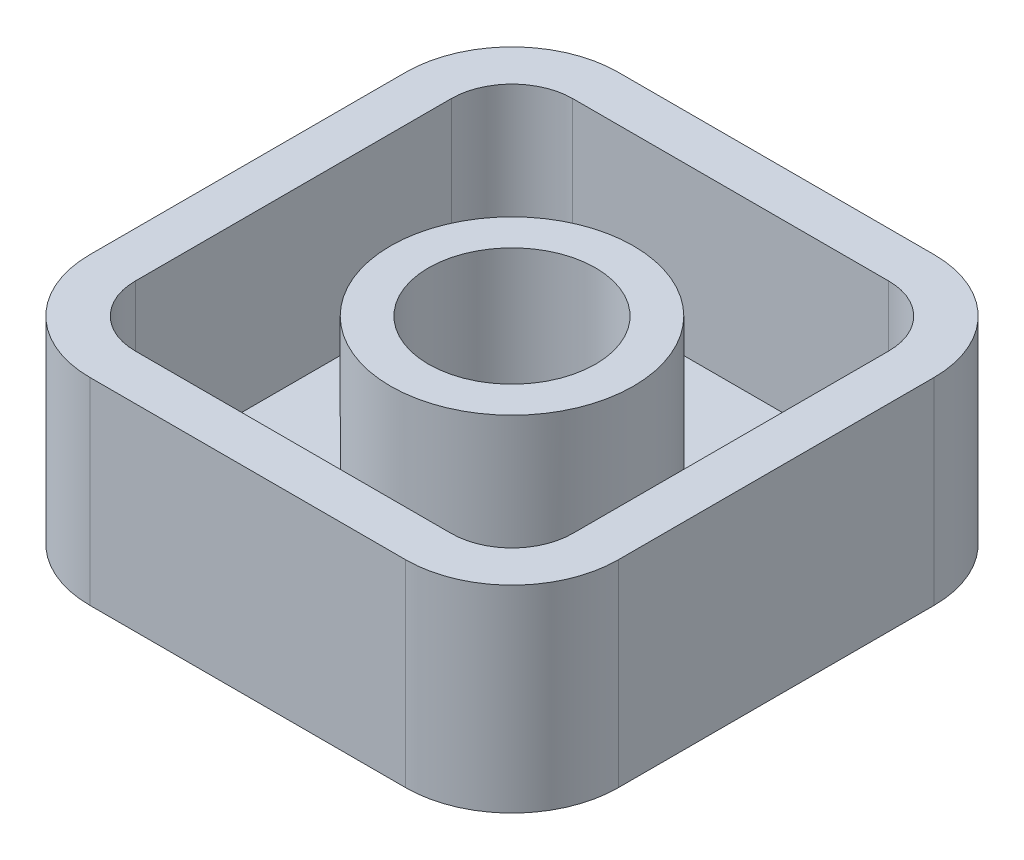
ISO-10303-21;
HEADER;
FILE_DESCRIPTION(('STEP AP214'),'2;1');
FILE_NAME('part.step','',(''),(''),'','','');
FILE_SCHEMA(('AUTOMOTIVE_DESIGN { 1 0 10303 214 1 1 1 1 }'));
ENDSEC;
DATA;
#1=APPLICATION_CONTEXT('core data for automotive mechanical design processes');
#2=APPLICATION_PROTOCOL_DEFINITION('international standard','automotive_design',2000,#1);
#3=PRODUCT_CONTEXT('',#1,'mechanical');
#4=PRODUCT('Part','Part','',(#3));
#5=PRODUCT_RELATED_PRODUCT_CATEGORY('part','',(#4));
#6=PRODUCT_DEFINITION_FORMATION('','',#4);
#7=PRODUCT_DEFINITION_CONTEXT('part definition',#1,'design');
#8=PRODUCT_DEFINITION('design','',#6,#7);
#9=PRODUCT_DEFINITION_SHAPE('','',#8);
#10=(LENGTH_UNIT() NAMED_UNIT(*) SI_UNIT(.MILLI.,.METRE.));
#11=(NAMED_UNIT(*) PLANE_ANGLE_UNIT() SI_UNIT($,.RADIAN.));
#12=(NAMED_UNIT(*) SI_UNIT($,.STERADIAN.) SOLID_ANGLE_UNIT());
#13=UNCERTAINTY_MEASURE_WITH_UNIT(LENGTH_MEASURE(1.E-05),#10,'distance_accuracy_value','');
#14=(GEOMETRIC_REPRESENTATION_CONTEXT(3) GLOBAL_UNCERTAINTY_ASSIGNED_CONTEXT((#13)) GLOBAL_UNIT_ASSIGNED_CONTEXT((#10,
#11,#12)) REPRESENTATION_CONTEXT('',''));
#15=CARTESIAN_POINT('',(0.,0.,0.));
#16=DIRECTION('',(0.,0.,1.));
#17=DIRECTION('',(1.,0.,0.));
#18=AXIS2_PLACEMENT_3D('',#15,#16,#17);
#19=CARTESIAN_POINT('',(0.,6.5,0.));
#20=DIRECTION('',(-1.,0.,0.));
#21=DIRECTION('',(0.,0.,1.));
#22=AXIS2_PLACEMENT_3D('',#19,#20,#21);
#23=PLANE('',#22);
#24=DIRECTION('',(0.,0.,-1.));
#25=VECTOR('',#24,1.);
#26=CARTESIAN_POINT('',(0.,0.,0.));
#27=LINE('',#26,#25);
#28=CARTESIAN_POINT('',(0.,0.,13.9));
#29=VERTEX_POINT('',#28);
#30=CARTESIAN_POINT('',(0.,0.,3.5));
#31=VERTEX_POINT('',#30);
#32=EDGE_CURVE('E217',#29,#31,#27,.T.);
#33=ORIENTED_EDGE('',*,*,#32,.T.);
#34=DIRECTION('',(0.,-1.,0.));
#35=VECTOR('',#34,1.);
#36=CARTESIAN_POINT('',(0.,6.5,3.5));
#37=LINE('',#36,#35);
#38=CARTESIAN_POINT('',(0.,6.5,3.5));
#39=VERTEX_POINT('',#38);
#40=EDGE_CURVE('E48',#31,#39,#37,.F.);
#41=ORIENTED_EDGE('',*,*,#40,.T.);
#42=DIRECTION('',(0.,0.,-1.));
#43=VECTOR('',#42,1.);
#44=CARTESIAN_POINT('',(0.,6.5,0.));
#45=LINE('',#44,#43);
#46=CARTESIAN_POINT('',(0.,6.5,13.9));
#47=VERTEX_POINT('',#46);
#48=EDGE_CURVE('E229',#47,#39,#45,.T.);
#49=ORIENTED_EDGE('',*,*,#48,.F.);
#50=DIRECTION('',(0.,-1.,0.));
#51=VECTOR('',#50,1.);
#52=CARTESIAN_POINT('',(0.,6.5,13.9));
#53=LINE('',#52,#51);
#54=EDGE_CURVE('E280',#47,#29,#53,.T.);
#55=ORIENTED_EDGE('',*,*,#54,.T.);
#56=EDGE_LOOP('',(#33,#41,#49,#55));
#57=FACE_BOUND('',#56,.T.);
#58=ADVANCED_FACE('F40',(#57),#23,.F.);
#59=CARTESIAN_POINT('',(0.,6.5,0.));
#60=DIRECTION('',(0.,0.,1.));
#61=DIRECTION('',(1.,0.,0.));
#62=AXIS2_PLACEMENT_3D('',#59,#60,#61);
#63=PLANE('',#62);
#64=DIRECTION('',(-1.,0.,0.));
#65=VECTOR('',#64,1.);
#66=CARTESIAN_POINT('',(0.,0.,0.));
#67=LINE('',#66,#65);
#68=CARTESIAN_POINT('',(-3.5,0.,0.));
#69=VERTEX_POINT('',#68);
#70=CARTESIAN_POINT('',(-13.9,0.,0.));
#71=VERTEX_POINT('',#70);
#72=EDGE_CURVE('E244',#69,#71,#67,.T.);
#73=ORIENTED_EDGE('',*,*,#72,.T.);
#74=DIRECTION('',(0.,-1.,0.));
#75=VECTOR('',#74,1.);
#76=CARTESIAN_POINT('',(-13.9,6.5,0.));
#77=LINE('',#76,#75);
#78=CARTESIAN_POINT('',(-13.9,6.5,0.));
#79=VERTEX_POINT('',#78);
#80=EDGE_CURVE('E63',#71,#79,#77,.F.);
#81=ORIENTED_EDGE('',*,*,#80,.T.);
#82=DIRECTION('',(-1.,0.,0.));
#83=VECTOR('',#82,1.);
#84=CARTESIAN_POINT('',(0.,6.5,0.));
#85=LINE('',#84,#83);
#86=CARTESIAN_POINT('',(-3.5,6.5,0.));
#87=VERTEX_POINT('',#86);
#88=EDGE_CURVE('E232',#87,#79,#85,.T.);
#89=ORIENTED_EDGE('',*,*,#88,.F.);
#90=DIRECTION('',(0.,-1.,0.));
#91=VECTOR('',#90,1.);
#92=CARTESIAN_POINT('',(-3.5,6.5,0.));
#93=LINE('',#92,#91);
#94=EDGE_CURVE('E276',#87,#69,#93,.T.);
#95=ORIENTED_EDGE('',*,*,#94,.T.);
#96=EDGE_LOOP('',(#73,#81,#89,#95));
#97=FACE_BOUND('',#96,.T.);
#98=ADVANCED_FACE('F295',(#97),#63,.F.);
#99=CARTESIAN_POINT('',(-17.4,6.5,0.));
#100=DIRECTION('',(1.,0.,0.));
#101=DIRECTION('',(0.,0.,-1.));
#102=AXIS2_PLACEMENT_3D('',#99,#100,#101);
#103=PLANE('',#102);
#104=DIRECTION('',(0.,0.,1.));
#105=VECTOR('',#104,1.);
#106=CARTESIAN_POINT('',(-17.4,0.,0.));
#107=LINE('',#106,#105);
#108=CARTESIAN_POINT('',(-17.4,0.,3.5));
#109=VERTEX_POINT('',#108);
#110=CARTESIAN_POINT('',(-17.4,0.,13.9));
#111=VERTEX_POINT('',#110);
#112=EDGE_CURVE('E246',#109,#111,#107,.T.);
#113=ORIENTED_EDGE('',*,*,#112,.T.);
#114=DIRECTION('',(0.,-1.,0.));
#115=VECTOR('',#114,1.);
#116=CARTESIAN_POINT('',(-17.4,6.5,13.9));
#117=LINE('',#116,#115);
#118=CARTESIAN_POINT('',(-17.4,6.5,13.9));
#119=VERTEX_POINT('',#118);
#120=EDGE_CURVE('E266',#111,#119,#117,.F.);
#121=ORIENTED_EDGE('',*,*,#120,.T.);
#122=DIRECTION('',(0.,0.,1.));
#123=VECTOR('',#122,1.);
#124=CARTESIAN_POINT('',(-17.4,6.5,0.));
#125=LINE('',#124,#123);
#126=CARTESIAN_POINT('',(-17.4,6.5,3.5));
#127=VERTEX_POINT('',#126);
#128=EDGE_CURVE('E235',#127,#119,#125,.T.);
#129=ORIENTED_EDGE('',*,*,#128,.F.);
#130=DIRECTION('',(0.,-1.,0.));
#131=VECTOR('',#130,1.);
#132=CARTESIAN_POINT('',(-17.4,6.5,3.5));
#133=LINE('',#132,#131);
#134=EDGE_CURVE('E263',#127,#109,#133,.T.);
#135=ORIENTED_EDGE('',*,*,#134,.T.);
#136=EDGE_LOOP('',(#113,#121,#129,#135));
#137=FACE_BOUND('',#136,.T.);
#138=ADVANCED_FACE('F306',(#137),#103,.F.);
#139=CARTESIAN_POINT('',(0.,6.5,17.4));
#140=DIRECTION('',(0.,0.,-1.));
#141=DIRECTION('',(-1.,0.,0.));
#142=AXIS2_PLACEMENT_3D('',#139,#140,#141);
#143=PLANE('',#142);
#144=DIRECTION('',(1.,0.,0.));
#145=VECTOR('',#144,1.);
#146=CARTESIAN_POINT('',(0.,6.5,17.4));
#147=LINE('',#146,#145);
#148=CARTESIAN_POINT('',(-13.9,6.5,17.4));
#149=VERTEX_POINT('',#148);
#150=CARTESIAN_POINT('',(-3.5,6.5,17.4));
#151=VERTEX_POINT('',#150);
#152=EDGE_CURVE('E238',#149,#151,#147,.T.);
#153=ORIENTED_EDGE('',*,*,#152,.F.);
#154=DIRECTION('',(0.,-1.,0.));
#155=VECTOR('',#154,1.);
#156=CARTESIAN_POINT('',(-13.9,6.5,17.4));
#157=LINE('',#156,#155);
#158=CARTESIAN_POINT('',(-13.9,0.,17.4));
#159=VERTEX_POINT('',#158);
#160=EDGE_CURVE('E252',#149,#159,#157,.T.);
#161=ORIENTED_EDGE('',*,*,#160,.T.);
#162=DIRECTION('',(1.,0.,0.));
#163=VECTOR('',#162,1.);
#164=CARTESIAN_POINT('',(0.,0.,17.4));
#165=LINE('',#164,#163);
#166=CARTESIAN_POINT('',(-3.5,0.,17.4));
#167=VERTEX_POINT('',#166);
#168=EDGE_CURVE('E233',#159,#167,#165,.T.);
#169=ORIENTED_EDGE('',*,*,#168,.T.);
#170=DIRECTION('',(0.,-1.,0.));
#171=VECTOR('',#170,1.);
#172=CARTESIAN_POINT('',(-3.5,6.5,17.4));
#173=LINE('',#172,#171);
#174=EDGE_CURVE('E241',#167,#151,#173,.F.);
#175=ORIENTED_EDGE('',*,*,#174,.T.);
#176=EDGE_LOOP('',(#153,#161,#169,#175));
#177=FACE_BOUND('',#176,.T.);
#178=ADVANCED_FACE('F314',(#177),#143,.F.);
#179=CARTESIAN_POINT('',(0.,6.5,0.));
#180=DIRECTION('',(0.,-1.,0.));
#181=DIRECTION('',(0.,0.,-1.));
#182=AXIS2_PLACEMENT_3D('',#179,#180,#181);
#183=PLANE('',#182);
#184=DIRECTION('',(1.,0.,0.));
#185=VECTOR('',#184,1.);
#186=CARTESIAN_POINT('',(-13.9,6.5,15.9));
#187=LINE('',#186,#185);
#188=CARTESIAN_POINT('',(-13.9,6.5,15.9));
#189=VERTEX_POINT('',#188);
#190=CARTESIAN_POINT('',(-3.5,6.5,15.9));
#191=VERTEX_POINT('',#190);
#192=EDGE_CURVE('E199',#189,#191,#187,.T.);
#193=ORIENTED_EDGE('',*,*,#192,.F.);
#194=CARTESIAN_POINT('',(-13.9,6.5,13.9));
#195=DIRECTION('',(0.,1.,0.));
#196=DIRECTION('',(0.,0.,-1.));
#197=AXIS2_PLACEMENT_3D('',#194,#195,#196);
#198=CIRCLE('',#197,2.);
#199=CARTESIAN_POINT('',(-15.9,6.5,13.9));
#200=VERTEX_POINT('',#199);
#201=EDGE_CURVE('E55',#200,#189,#198,.T.);
#202=ORIENTED_EDGE('',*,*,#201,.F.);
#203=DIRECTION('',(0.,0.,1.));
#204=VECTOR('',#203,1.);
#205=CARTESIAN_POINT('',(-15.9,6.5,13.9));
#206=LINE('',#205,#204);
#207=CARTESIAN_POINT('',(-15.9,6.5,3.5));
#208=VERTEX_POINT('',#207);
#209=EDGE_CURVE('E176',#208,#200,#206,.T.);
#210=ORIENTED_EDGE('',*,*,#209,.F.);
#211=CARTESIAN_POINT('',(-13.9,6.5,3.5));
#212=DIRECTION('',(0.,1.,0.));
#213=DIRECTION('',(0.,0.,1.));
#214=AXIS2_PLACEMENT_3D('',#211,#212,#213);
#215=CIRCLE('',#214,2.);
#216=CARTESIAN_POINT('',(-13.9,6.5,1.5));
#217=VERTEX_POINT('',#216);
#218=EDGE_CURVE('E179',#217,#208,#215,.T.);
#219=ORIENTED_EDGE('',*,*,#218,.F.);
#220=DIRECTION('',(-1.,0.,0.));
#221=VECTOR('',#220,1.);
#222=CARTESIAN_POINT('',(-13.9,6.5,1.5));
#223=LINE('',#222,#221);
#224=CARTESIAN_POINT('',(-3.50000000000001,6.5,1.5));
#225=VERTEX_POINT('',#224);
#226=EDGE_CURVE('E210',#225,#217,#223,.T.);
#227=ORIENTED_EDGE('',*,*,#226,.F.);
#228=CARTESIAN_POINT('',(-3.5,6.5,3.5));
#229=DIRECTION('',(0.,1.,0.));
#230=DIRECTION('',(0.,0.,-1.));
#231=AXIS2_PLACEMENT_3D('',#228,#229,#230);
#232=CIRCLE('',#231,2.);
#233=CARTESIAN_POINT('',(-1.5,6.5,3.50000000000001));
#234=VERTEX_POINT('',#233);
#235=EDGE_CURVE('E207',#234,#225,#232,.T.);
#236=ORIENTED_EDGE('',*,*,#235,.F.);
#237=DIRECTION('',(0.,0.,-1.));
#238=VECTOR('',#237,1.);
#239=CARTESIAN_POINT('',(-1.5,6.5,13.9));
#240=LINE('',#239,#238);
#241=CARTESIAN_POINT('',(-1.5,6.5,13.9));
#242=VERTEX_POINT('',#241);
#243=EDGE_CURVE('E204',#242,#234,#240,.T.);
#244=ORIENTED_EDGE('',*,*,#243,.F.);
#245=CARTESIAN_POINT('',(-3.5,6.5,13.9));
#246=DIRECTION('',(0.,1.,0.));
#247=DIRECTION('',(0.,0.,1.));
#248=AXIS2_PLACEMENT_3D('',#245,#246,#247);
#249=CIRCLE('',#248,2.);
#250=EDGE_CURVE('E201',#191,#242,#249,.T.);
#251=ORIENTED_EDGE('',*,*,#250,.F.);
#252=EDGE_LOOP('',(#193,#202,#210,#219,#227,#236,#244,#251));
#253=FACE_BOUND('',#252,.T.);
#254=ORIENTED_EDGE('',*,*,#128,.T.);
#255=CARTESIAN_POINT('',(-13.9,6.5,13.9));
#256=DIRECTION('',(0.,-1.,0.));
#257=DIRECTION('',(0.,0.,-1.));
#258=AXIS2_PLACEMENT_3D('',#255,#256,#257);
#259=CIRCLE('',#258,3.5);
#260=EDGE_CURVE('E274',#119,#149,#259,.F.);
#261=ORIENTED_EDGE('',*,*,#260,.T.);
#262=ORIENTED_EDGE('',*,*,#152,.T.);
#263=CARTESIAN_POINT('',(-3.5,6.5,13.9));
#264=DIRECTION('',(0.,-1.,0.));
#265=DIRECTION('',(0.,0.,-1.));
#266=AXIS2_PLACEMENT_3D('',#263,#264,#265);
#267=CIRCLE('',#266,3.5);
#268=EDGE_CURVE('E268',#151,#47,#267,.F.);
#269=ORIENTED_EDGE('',*,*,#268,.T.);
#270=ORIENTED_EDGE('',*,*,#48,.T.);
#271=CARTESIAN_POINT('',(-3.5,6.5,3.5));
#272=DIRECTION('',(0.,-1.,0.));
#273=DIRECTION('',(0.,0.,-1.));
#274=AXIS2_PLACEMENT_3D('',#271,#272,#273);
#275=CIRCLE('',#274,3.5);
#276=EDGE_CURVE('E270',#39,#87,#275,.F.);
#277=ORIENTED_EDGE('',*,*,#276,.T.);
#278=ORIENTED_EDGE('',*,*,#88,.T.);
#279=CARTESIAN_POINT('',(-13.9,6.5,3.5));
#280=DIRECTION('',(0.,-1.,0.));
#281=DIRECTION('',(0.,0.,-1.));
#282=AXIS2_PLACEMENT_3D('',#279,#280,#281);
#283=CIRCLE('',#282,3.5);
#284=EDGE_CURVE('E272',#79,#127,#283,.F.);
#285=ORIENTED_EDGE('',*,*,#284,.T.);
#286=EDGE_LOOP('',(#254,#261,#262,#269,#270,#277,#278,#285));
#287=FACE_BOUND('',#286,.T.);
#288=ADVANCED_FACE('F290',(#253,#287),#183,.F.);
#289=CARTESIAN_POINT('',(0.,0.,0.));
#290=DIRECTION('',(0.,-1.,0.));
#291=DIRECTION('',(0.,0.,-1.));
#292=AXIS2_PLACEMENT_3D('',#289,#290,#291);
#293=PLANE('',#292);
#294=ORIENTED_EDGE('',*,*,#168,.F.);
#295=CARTESIAN_POINT('',(-13.9,0.,13.9));
#296=DIRECTION('',(0.,-1.,0.));
#297=DIRECTION('',(0.,0.,-1.));
#298=AXIS2_PLACEMENT_3D('',#295,#296,#297);
#299=CIRCLE('',#298,3.5);
#300=EDGE_CURVE('E261',#159,#111,#299,.T.);
#301=ORIENTED_EDGE('',*,*,#300,.T.);
#302=ORIENTED_EDGE('',*,*,#112,.F.);
#303=CARTESIAN_POINT('',(-13.9,0.,3.5));
#304=DIRECTION('',(0.,-1.,0.));
#305=DIRECTION('',(0.,0.,-1.));
#306=AXIS2_PLACEMENT_3D('',#303,#304,#305);
#307=CIRCLE('',#306,3.5);
#308=EDGE_CURVE('E259',#109,#71,#307,.T.);
#309=ORIENTED_EDGE('',*,*,#308,.T.);
#310=ORIENTED_EDGE('',*,*,#72,.F.);
#311=CARTESIAN_POINT('',(-3.5,0.,3.5));
#312=DIRECTION('',(0.,-1.,0.));
#313=DIRECTION('',(0.,0.,-1.));
#314=AXIS2_PLACEMENT_3D('',#311,#312,#313);
#315=CIRCLE('',#314,3.5);
#316=EDGE_CURVE('E257',#69,#31,#315,.T.);
#317=ORIENTED_EDGE('',*,*,#316,.T.);
#318=ORIENTED_EDGE('',*,*,#32,.F.);
#319=CARTESIAN_POINT('',(-3.5,0.,13.9));
#320=DIRECTION('',(0.,-1.,0.));
#321=DIRECTION('',(0.,0.,-1.));
#322=AXIS2_PLACEMENT_3D('',#319,#320,#321);
#323=CIRCLE('',#322,3.5);
#324=EDGE_CURVE('E255',#29,#167,#323,.T.);
#325=ORIENTED_EDGE('',*,*,#324,.T.);
#326=EDGE_LOOP('',(#294,#301,#302,#309,#310,#317,#318,#325));
#327=FACE_BOUND('',#326,.T.);
#328=ADVANCED_FACE('F298',(#327),#293,.T.);
#329=CARTESIAN_POINT('',(-13.9,6.5,13.9));
#330=DIRECTION('',(0.,-1.,0.));
#331=DIRECTION('',(0.,0.,-1.));
#332=AXIS2_PLACEMENT_3D('',#329,#330,#331);
#333=CYLINDRICAL_SURFACE('',#332,3.5);
#334=ORIENTED_EDGE('',*,*,#260,.F.);
#335=ORIENTED_EDGE('',*,*,#120,.F.);
#336=ORIENTED_EDGE('',*,*,#300,.F.);
#337=ORIENTED_EDGE('',*,*,#160,.F.);
#338=EDGE_LOOP('',(#334,#335,#336,#337));
#339=FACE_BOUND('',#338,.T.);
#340=ADVANCED_FACE('F312',(#339),#333,.T.);
#341=CARTESIAN_POINT('',(-13.9,6.5,3.5));
#342=DIRECTION('',(0.,-1.,0.));
#343=DIRECTION('',(0.,0.,-1.));
#344=AXIS2_PLACEMENT_3D('',#341,#342,#343);
#345=CYLINDRICAL_SURFACE('',#344,3.5);
#346=ORIENTED_EDGE('',*,*,#284,.F.);
#347=ORIENTED_EDGE('',*,*,#80,.F.);
#348=ORIENTED_EDGE('',*,*,#308,.F.);
#349=ORIENTED_EDGE('',*,*,#134,.F.);
#350=EDGE_LOOP('',(#346,#347,#348,#349));
#351=FACE_BOUND('',#350,.T.);
#352=ADVANCED_FACE('F303',(#351),#345,.T.);
#353=CARTESIAN_POINT('',(-3.5,6.5,3.5));
#354=DIRECTION('',(0.,-1.,0.));
#355=DIRECTION('',(0.,0.,-1.));
#356=AXIS2_PLACEMENT_3D('',#353,#354,#355);
#357=CYLINDRICAL_SURFACE('',#356,3.5);
#358=ORIENTED_EDGE('',*,*,#276,.F.);
#359=ORIENTED_EDGE('',*,*,#40,.F.);
#360=ORIENTED_EDGE('',*,*,#316,.F.);
#361=ORIENTED_EDGE('',*,*,#94,.F.);
#362=EDGE_LOOP('',(#358,#359,#360,#361));
#363=FACE_BOUND('',#362,.T.);
#364=ADVANCED_FACE('F293',(#363),#357,.T.);
#365=CARTESIAN_POINT('',(-3.5,6.5,13.9));
#366=DIRECTION('',(0.,-1.,0.));
#367=DIRECTION('',(0.,0.,-1.));
#368=AXIS2_PLACEMENT_3D('',#365,#366,#367);
#369=CYLINDRICAL_SURFACE('',#368,3.5);
#370=ORIENTED_EDGE('',*,*,#268,.F.);
#371=ORIENTED_EDGE('',*,*,#174,.F.);
#372=ORIENTED_EDGE('',*,*,#324,.F.);
#373=ORIENTED_EDGE('',*,*,#54,.F.);
#374=EDGE_LOOP('',(#370,#371,#372,#373));
#375=FACE_BOUND('',#374,.T.);
#376=ADVANCED_FACE('F42',(#375),#369,.T.);
#377=CARTESIAN_POINT('',(-13.9,1.,13.9));
#378=DIRECTION('',(0.,1.,0.));
#379=DIRECTION('',(0.,0.,1.));
#380=AXIS2_PLACEMENT_3D('',#377,#378,#379);
#381=CYLINDRICAL_SURFACE('',#380,2.);
#382=ORIENTED_EDGE('',*,*,#201,.T.);
#383=DIRECTION('',(0.,1.,0.));
#384=VECTOR('',#383,1.);
#385=CARTESIAN_POINT('',(-13.9,1.,15.9));
#386=LINE('',#385,#384);
#387=CARTESIAN_POINT('',(-13.9,1.,15.9));
#388=VERTEX_POINT('',#387);
#389=EDGE_CURVE('E153',#388,#189,#386,.T.);
#390=ORIENTED_EDGE('',*,*,#389,.F.);
#391=CARTESIAN_POINT('',(-13.9,1.,13.9));
#392=DIRECTION('',(0.,1.,0.));
#393=DIRECTION('',(0.,0.,-1.));
#394=AXIS2_PLACEMENT_3D('',#391,#392,#393);
#395=CIRCLE('',#394,2.);
#396=CARTESIAN_POINT('',(-15.9,1.,13.9));
#397=VERTEX_POINT('',#396);
#398=EDGE_CURVE('E157',#397,#388,#395,.T.);
#399=ORIENTED_EDGE('',*,*,#398,.F.);
#400=DIRECTION('',(0.,1.,0.));
#401=VECTOR('',#400,1.);
#402=CARTESIAN_POINT('',(-15.9,1.,13.9));
#403=LINE('',#402,#401);
#404=EDGE_CURVE('E215',#397,#200,#403,.T.);
#405=ORIENTED_EDGE('',*,*,#404,.T.);
#406=EDGE_LOOP('',(#382,#390,#399,#405));
#407=FACE_BOUND('',#406,.T.);
#408=ADVANCED_FACE('F155',(#407),#381,.F.);
#409=CARTESIAN_POINT('',(-15.9,1.,13.9));
#410=DIRECTION('',(-1.,0.,0.));
#411=DIRECTION('',(0.,0.,1.));
#412=AXIS2_PLACEMENT_3D('',#409,#410,#411);
#413=PLANE('',#412);
#414=ORIENTED_EDGE('',*,*,#209,.T.);
#415=ORIENTED_EDGE('',*,*,#404,.F.);
#416=DIRECTION('',(0.,0.,1.));
#417=VECTOR('',#416,1.);
#418=CARTESIAN_POINT('',(-15.9,1.,13.9));
#419=LINE('',#418,#417);
#420=CARTESIAN_POINT('',(-15.9,1.,3.5));
#421=VERTEX_POINT('',#420);
#422=EDGE_CURVE('E163',#421,#397,#419,.T.);
#423=ORIENTED_EDGE('',*,*,#422,.F.);
#424=DIRECTION('',(0.,1.,0.));
#425=VECTOR('',#424,1.);
#426=CARTESIAN_POINT('',(-15.9,1.,3.5));
#427=LINE('',#426,#425);
#428=EDGE_CURVE('E218',#421,#208,#427,.T.);
#429=ORIENTED_EDGE('',*,*,#428,.T.);
#430=EDGE_LOOP('',(#414,#415,#423,#429));
#431=FACE_BOUND('',#430,.T.);
#432=ADVANCED_FACE('F322',(#431),#413,.F.);
#433=CARTESIAN_POINT('',(-13.9,1.,3.5));
#434=DIRECTION('',(0.,1.,0.));
#435=DIRECTION('',(0.,0.,1.));
#436=AXIS2_PLACEMENT_3D('',#433,#434,#435);
#437=CYLINDRICAL_SURFACE('',#436,2.);
#438=ORIENTED_EDGE('',*,*,#218,.T.);
#439=ORIENTED_EDGE('',*,*,#428,.F.);
#440=CARTESIAN_POINT('',(-13.9,1.,3.5));
#441=DIRECTION('',(0.,1.,0.));
#442=DIRECTION('',(0.,0.,1.));
#443=AXIS2_PLACEMENT_3D('',#440,#441,#442);
#444=CIRCLE('',#443,2.);
#445=CARTESIAN_POINT('',(-13.9,1.,1.5));
#446=VERTEX_POINT('',#445);
#447=EDGE_CURVE('E195',#446,#421,#444,.T.);
#448=ORIENTED_EDGE('',*,*,#447,.F.);
#449=DIRECTION('',(0.,1.,0.));
#450=VECTOR('',#449,1.);
#451=CARTESIAN_POINT('',(-13.9,1.,1.5));
#452=LINE('',#451,#450);
#453=EDGE_CURVE('E220',#446,#217,#452,.T.);
#454=ORIENTED_EDGE('',*,*,#453,.T.);
#455=EDGE_LOOP('',(#438,#439,#448,#454));
#456=FACE_BOUND('',#455,.T.);
#457=ADVANCED_FACE('F364',(#456),#437,.F.);
#458=CARTESIAN_POINT('',(-13.9,1.,1.5));
#459=DIRECTION('',(0.,0.,-1.));
#460=DIRECTION('',(-1.,0.,0.));
#461=AXIS2_PLACEMENT_3D('',#458,#459,#460);
#462=PLANE('',#461);
#463=ORIENTED_EDGE('',*,*,#226,.T.);
#464=ORIENTED_EDGE('',*,*,#453,.F.);
#465=DIRECTION('',(-1.,0.,0.));
#466=VECTOR('',#465,1.);
#467=CARTESIAN_POINT('',(-13.9,1.,1.5));
#468=LINE('',#467,#466);
#469=CARTESIAN_POINT('',(-3.50000000000001,1.,1.5));
#470=VERTEX_POINT('',#469);
#471=EDGE_CURVE('E192',#470,#446,#468,.T.);
#472=ORIENTED_EDGE('',*,*,#471,.F.);
#473=DIRECTION('',(0.,1.,0.));
#474=VECTOR('',#473,1.);
#475=CARTESIAN_POINT('',(-3.50000000000001,1.,1.5));
#476=LINE('',#475,#474);
#477=EDGE_CURVE('E222',#470,#225,#476,.T.);
#478=ORIENTED_EDGE('',*,*,#477,.T.);
#479=EDGE_LOOP('',(#463,#464,#472,#478));
#480=FACE_BOUND('',#479,.T.);
#481=ADVANCED_FACE('F374',(#480),#462,.F.);
#482=CARTESIAN_POINT('',(-3.5,1.,3.5));
#483=DIRECTION('',(0.,1.,0.));
#484=DIRECTION('',(0.,0.,1.));
#485=AXIS2_PLACEMENT_3D('',#482,#483,#484);
#486=CYLINDRICAL_SURFACE('',#485,2.);
#487=ORIENTED_EDGE('',*,*,#235,.T.);
#488=ORIENTED_EDGE('',*,*,#477,.F.);
#489=CARTESIAN_POINT('',(-3.5,1.,3.5));
#490=DIRECTION('',(0.,1.,0.));
#491=DIRECTION('',(0.,0.,-1.));
#492=AXIS2_PLACEMENT_3D('',#489,#490,#491);
#493=CIRCLE('',#492,2.);
#494=CARTESIAN_POINT('',(-1.5,1.,3.50000000000001));
#495=VERTEX_POINT('',#494);
#496=EDGE_CURVE('E189',#495,#470,#493,.T.);
#497=ORIENTED_EDGE('',*,*,#496,.F.);
#498=DIRECTION('',(0.,1.,0.));
#499=VECTOR('',#498,1.);
#500=CARTESIAN_POINT('',(-1.5,1.,3.50000000000001));
#501=LINE('',#500,#499);
#502=EDGE_CURVE('E224',#495,#234,#501,.T.);
#503=ORIENTED_EDGE('',*,*,#502,.T.);
#504=EDGE_LOOP('',(#487,#488,#497,#503));
#505=FACE_BOUND('',#504,.T.);
#506=ADVANCED_FACE('F384',(#505),#486,.F.);
#507=CARTESIAN_POINT('',(-1.5,1.,13.9));
#508=DIRECTION('',(1.,0.,0.));
#509=DIRECTION('',(0.,0.,-1.));
#510=AXIS2_PLACEMENT_3D('',#507,#508,#509);
#511=PLANE('',#510);
#512=ORIENTED_EDGE('',*,*,#243,.T.);
#513=ORIENTED_EDGE('',*,*,#502,.F.);
#514=DIRECTION('',(0.,0.,-1.));
#515=VECTOR('',#514,1.);
#516=CARTESIAN_POINT('',(-1.5,1.,13.9));
#517=LINE('',#516,#515);
#518=CARTESIAN_POINT('',(-1.5,1.,13.9));
#519=VERTEX_POINT('',#518);
#520=EDGE_CURVE('E186',#519,#495,#517,.T.);
#521=ORIENTED_EDGE('',*,*,#520,.F.);
#522=DIRECTION('',(0.,1.,0.));
#523=VECTOR('',#522,1.);
#524=CARTESIAN_POINT('',(-1.5,1.,13.9));
#525=LINE('',#524,#523);
#526=EDGE_CURVE('E226',#519,#242,#525,.T.);
#527=ORIENTED_EDGE('',*,*,#526,.T.);
#528=EDGE_LOOP('',(#512,#513,#521,#527));
#529=FACE_BOUND('',#528,.T.);
#530=ADVANCED_FACE('F394',(#529),#511,.F.);
#531=CARTESIAN_POINT('',(-3.5,1.,13.9));
#532=DIRECTION('',(0.,1.,0.));
#533=DIRECTION('',(0.,0.,1.));
#534=AXIS2_PLACEMENT_3D('',#531,#532,#533);
#535=CYLINDRICAL_SURFACE('',#534,2.);
#536=ORIENTED_EDGE('',*,*,#250,.T.);
#537=ORIENTED_EDGE('',*,*,#526,.F.);
#538=CARTESIAN_POINT('',(-3.5,1.,13.9));
#539=DIRECTION('',(0.,1.,0.));
#540=DIRECTION('',(0.,0.,1.));
#541=AXIS2_PLACEMENT_3D('',#538,#539,#540);
#542=CIRCLE('',#541,2.);
#543=CARTESIAN_POINT('',(-3.5,1.,15.9));
#544=VERTEX_POINT('',#543);
#545=EDGE_CURVE('E171',#544,#519,#542,.T.);
#546=ORIENTED_EDGE('',*,*,#545,.F.);
#547=DIRECTION('',(0.,1.,0.));
#548=VECTOR('',#547,1.);
#549=CARTESIAN_POINT('',(-3.5,1.,15.9));
#550=LINE('',#549,#548);
#551=EDGE_CURVE('E162',#544,#191,#550,.T.);
#552=ORIENTED_EDGE('',*,*,#551,.T.);
#553=EDGE_LOOP('',(#536,#537,#546,#552));
#554=FACE_BOUND('',#553,.T.);
#555=ADVANCED_FACE('F404',(#554),#535,.F.);
#556=CARTESIAN_POINT('',(-13.9,1.,15.9));
#557=DIRECTION('',(0.,0.,1.));
#558=DIRECTION('',(1.,0.,0.));
#559=AXIS2_PLACEMENT_3D('',#556,#557,#558);
#560=PLANE('',#559);
#561=ORIENTED_EDGE('',*,*,#192,.T.);
#562=ORIENTED_EDGE('',*,*,#551,.F.);
#563=DIRECTION('',(1.,0.,0.));
#564=VECTOR('',#563,1.);
#565=CARTESIAN_POINT('',(-13.9,1.,15.9));
#566=LINE('',#565,#564);
#567=EDGE_CURVE('E166',#388,#544,#566,.T.);
#568=ORIENTED_EDGE('',*,*,#567,.F.);
#569=ORIENTED_EDGE('',*,*,#389,.T.);
#570=EDGE_LOOP('',(#561,#562,#568,#569));
#571=FACE_BOUND('',#570,.T.);
#572=ADVANCED_FACE('F167',(#571),#560,.F.);
#573=CARTESIAN_POINT('',(-13.9,1.,13.9));
#574=DIRECTION('',(0.,-1.,0.));
#575=DIRECTION('',(0.,0.,-1.));
#576=AXIS2_PLACEMENT_3D('',#573,#574,#575);
#577=PLANE('',#576);
#578=CARTESIAN_POINT('',(-8.7,1.,8.7));
#579=DIRECTION('',(0.,-1.,0.));
#580=DIRECTION('',(0.,0.,-1.));
#581=AXIS2_PLACEMENT_3D('',#578,#579,#580);
#582=CIRCLE('',#581,4.);
#583=CARTESIAN_POINT('',(-8.7,1.,4.7));
#584=VERTEX_POINT('',#583);
#585=EDGE_CURVE('E11',#584,#584,#582,.F.);
#586=ORIENTED_EDGE('',*,*,#585,.F.);
#587=EDGE_LOOP('',(#586));
#588=FACE_BOUND('',#587,.T.);
#589=ORIENTED_EDGE('',*,*,#398,.T.);
#590=ORIENTED_EDGE('',*,*,#567,.T.);
#591=ORIENTED_EDGE('',*,*,#545,.T.);
#592=ORIENTED_EDGE('',*,*,#520,.T.);
#593=ORIENTED_EDGE('',*,*,#496,.T.);
#594=ORIENTED_EDGE('',*,*,#471,.T.);
#595=ORIENTED_EDGE('',*,*,#447,.T.);
#596=ORIENTED_EDGE('',*,*,#422,.T.);
#597=EDGE_LOOP('',(#589,#590,#591,#592,#593,#594,#595,#596));
#598=FACE_BOUND('',#597,.T.);
#599=ADVANCED_FACE('F173',(#588,#598),#577,.F.);
#600=CARTESIAN_POINT('',(-8.7,6.5,8.7));
#601=DIRECTION('',(0.,1.,0.));
#602=DIRECTION('',(0.,0.,1.));
#603=AXIS2_PLACEMENT_3D('',#600,#601,#602);
#604=PLANE('',#603);
#605=CARTESIAN_POINT('',(-8.7,6.5,8.7));
#606=DIRECTION('',(0.,1.,0.));
#607=DIRECTION('',(0.,0.,1.));
#608=AXIS2_PLACEMENT_3D('',#605,#606,#607);
#609=CIRCLE('',#608,4.);
#610=CARTESIAN_POINT('',(-8.7,6.5,12.7));
#611=VERTEX_POINT('',#610);
#612=EDGE_CURVE('E182',#611,#611,#609,.T.);
#613=ORIENTED_EDGE('',*,*,#612,.T.);
#614=EDGE_LOOP('',(#613));
#615=FACE_BOUND('',#614,.T.);
#616=CARTESIAN_POINT('',(-8.7,6.5,8.7));
#617=DIRECTION('',(0.,1.,0.));
#618=DIRECTION('',(0.,0.,1.));
#619=AXIS2_PLACEMENT_3D('',#616,#617,#618);
#620=CIRCLE('',#619,2.75);
#621=CARTESIAN_POINT('',(-8.7,6.5,11.45));
#622=VERTEX_POINT('',#621);
#623=EDGE_CURVE('E630',#622,#622,#620,.T.);
#624=ORIENTED_EDGE('',*,*,#623,.F.);
#625=EDGE_LOOP('',(#624));
#626=FACE_BOUND('',#625,.T.);
#627=ADVANCED_FACE('F431',(#615,#626),#604,.T.);
#628=CARTESIAN_POINT('',(-8.7,6.5,8.7));
#629=DIRECTION('',(0.,-1.,0.));
#630=DIRECTION('',(0.,0.,-1.));
#631=AXIS2_PLACEMENT_3D('',#628,#629,#630);
#632=CYLINDRICAL_SURFACE('',#631,4.);
#633=ORIENTED_EDGE('',*,*,#612,.F.);
#634=EDGE_LOOP('',(#633));
#635=FACE_BOUND('',#634,.T.);
#636=ORIENTED_EDGE('',*,*,#585,.T.);
#637=EDGE_LOOP('',(#636));
#638=FACE_BOUND('',#637,.T.);
#639=ADVANCED_FACE('F441',(#635,#638),#632,.T.);
#640=CARTESIAN_POINT('',(-8.7,6.5,8.7));
#641=DIRECTION('',(0.,-1.,0.));
#642=DIRECTION('',(0.,0.,-1.));
#643=AXIS2_PLACEMENT_3D('',#640,#641,#642);
#644=CYLINDRICAL_SURFACE('',#643,2.75);
#645=ORIENTED_EDGE('',*,*,#623,.T.);
#646=EDGE_LOOP('',(#645));
#647=FACE_BOUND('',#646,.T.);
#648=CARTESIAN_POINT('',(-8.7,0.6,8.7));
#649=DIRECTION('',(0.,1.,0.));
#650=DIRECTION('',(0.,0.,1.));
#651=AXIS2_PLACEMENT_3D('',#648,#649,#650);
#652=CIRCLE('',#651,2.75);
#653=CARTESIAN_POINT('',(-8.7,0.6,11.45));
#654=VERTEX_POINT('',#653);
#655=EDGE_CURVE('E628',#654,#654,#652,.T.);
#656=ORIENTED_EDGE('',*,*,#655,.F.);
#657=EDGE_LOOP('',(#656));
#658=FACE_BOUND('',#657,.T.);
#659=ADVANCED_FACE('F451',(#647,#658),#644,.F.);
#660=CARTESIAN_POINT('',(-8.7,0.6,8.7));
#661=DIRECTION('',(0.,1.,0.));
#662=DIRECTION('',(0.,0.,1.));
#663=AXIS2_PLACEMENT_3D('',#660,#661,#662);
#664=PLANE('',#663);
#665=ORIENTED_EDGE('',*,*,#655,.T.);
#666=EDGE_LOOP('',(#665));
#667=FACE_BOUND('',#666,.T.);
#668=ADVANCED_FACE('F461',(#667),#664,.T.);
#669=CLOSED_SHELL('',(#58,#98,#138,#178,#288,#328,#340,#352,#364,#376,#408,#432,#457,#481,#506,
#530,#555,#572,#599,#627,#639,#659,#668));
#670=MANIFOLD_SOLID_BREP('B2',#669);
#671=ADVANCED_BREP_SHAPE_REPRESENTATION('',(#18,#670),#14);
#672=SHAPE_DEFINITION_REPRESENTATION(#9,#671);
ENDSEC;
END-ISO-10303-21;
